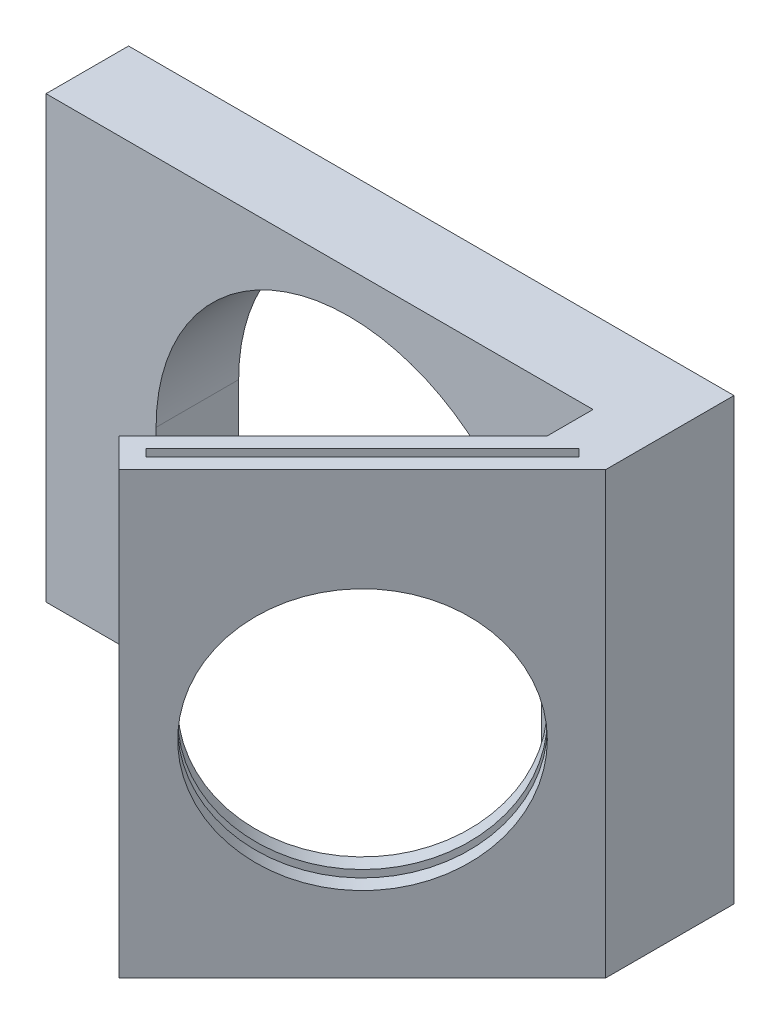
ISO-10303-21;
HEADER;
FILE_DESCRIPTION(('STEP AP214'),'2;1');
FILE_NAME('part.step','',(''),(''),'','','');
FILE_SCHEMA(('AUTOMOTIVE_DESIGN { 1 0 10303 214 1 1 1 1 }'));
ENDSEC;
DATA;
#1=APPLICATION_CONTEXT('core data for automotive mechanical design processes');
#2=APPLICATION_PROTOCOL_DEFINITION('international standard','automotive_design',2000,#1);
#3=PRODUCT_CONTEXT('',#1,'mechanical');
#4=PRODUCT('Part','Part','',(#3));
#5=PRODUCT_RELATED_PRODUCT_CATEGORY('part','',(#4));
#6=PRODUCT_DEFINITION_FORMATION('','',#4);
#7=PRODUCT_DEFINITION_CONTEXT('part definition',#1,'design');
#8=PRODUCT_DEFINITION('design','',#6,#7);
#9=PRODUCT_DEFINITION_SHAPE('','',#8);
#10=(LENGTH_UNIT() NAMED_UNIT(*) SI_UNIT(.MILLI.,.METRE.));
#11=(NAMED_UNIT(*) PLANE_ANGLE_UNIT() SI_UNIT($,.RADIAN.));
#12=(NAMED_UNIT(*) SI_UNIT($,.STERADIAN.) SOLID_ANGLE_UNIT());
#13=UNCERTAINTY_MEASURE_WITH_UNIT(LENGTH_MEASURE(1.E-05),#10,'distance_accuracy_value','');
#14=(GEOMETRIC_REPRESENTATION_CONTEXT(3) GLOBAL_UNCERTAINTY_ASSIGNED_CONTEXT((#13)) GLOBAL_UNIT_ASSIGNED_CONTEXT((#10,
#11,#12)) REPRESENTATION_CONTEXT('',''));
#15=CARTESIAN_POINT('',(0.,0.,0.));
#16=DIRECTION('',(0.,0.,1.));
#17=DIRECTION('',(1.,0.,0.));
#18=AXIS2_PLACEMENT_3D('',#15,#16,#17);
#19=CARTESIAN_POINT('',(-13.5010125,0.,-8.50101250000002));
#20=DIRECTION('',(0.707106781186546,0.,0.707106781186549));
#21=DIRECTION('',(0.707106781186549,0.,-0.707106781186546));
#22=AXIS2_PLACEMENT_3D('',#19,#20,#21);
#23=CYLINDRICAL_SURFACE('',#22,9.5);
#24=CARTESIAN_POINT('',(11.8353400204434,0.,16.8353400204434));
#25=DIRECTION('',(-0.707106781186548,0.,-0.707106781186548));
#26=DIRECTION('',(-0.707106781186547,0.,0.707106781186548));
#27=AXIS2_PLACEMENT_3D('',#24,#25,#26);
#28=CIRCLE('',#27,9.5);
#29=CARTESIAN_POINT('',(5.11782559917116,0.,23.5528544417156));
#30=VERTEX_POINT('',#29);
#31=EDGE_CURVE('E36',#30,#30,#28,.F.);
#32=ORIENTED_EDGE('',*,*,#31,.T.);
#33=EDGE_LOOP('',(#32));
#34=FACE_BOUND('',#33,.T.);
#35=CARTESIAN_POINT('',(11.0398448916085,0.,16.0398448916086));
#36=DIRECTION('',(-0.707106781186544,0.,-0.707106781186551));
#37=DIRECTION('',(-0.707106781186551,0.,0.707106781186544));
#38=AXIS2_PLACEMENT_3D('',#35,#36,#37);
#39=CIRCLE('',#38,9.5);
#40=CARTESIAN_POINT('',(17.7573593128808,0.,9.3223304703364));
#41=VERTEX_POINT('',#40);
#42=EDGE_CURVE('E55',#41,#41,#39,.F.);
#43=ORIENTED_EDGE('',*,*,#42,.F.);
#44=EDGE_LOOP('',(#43));
#45=FACE_BOUND('',#44,.T.);
#46=ADVANCED_FACE('F32',(#34,#45),#23,.F.);
#47=CARTESIAN_POINT('',(-22.,17.,6.));
#48=DIRECTION('',(0.,-1.,0.));
#49=DIRECTION('',(0.,0.,-1.));
#50=AXIS2_PLACEMENT_3D('',#47,#48,#49);
#51=PLANE('',#50);
#52=DIRECTION('',(0.707106781186547,0.,-0.707106781186548));
#53=VECTOR('',#52,1.);
#54=CARTESIAN_POINT('',(4.49910716563293,17.,25.2322330470337));
#55=LINE('',#54,#53);
#56=CARTESIAN_POINT('',(4.49910716563293,17.,25.2322330470336));
#57=VERTEX_POINT('',#56);
#58=CARTESIAN_POINT('',(20.2322330470336,17.,9.49910716563297));
#59=VERTEX_POINT('',#58);
#60=EDGE_CURVE('E179',#57,#59,#55,.T.);
#61=ORIENTED_EDGE('',*,*,#60,.F.);
#62=DIRECTION('',(0.707106781186546,0.,0.707106781186549));
#63=VECTOR('',#62,1.);
#64=CARTESIAN_POINT('',(3.96877707974302,17.,24.7019029611437));
#65=LINE('',#64,#63);
#66=CARTESIAN_POINT('',(3.96877707974302,17.,24.7019029611437));
#67=VERTEX_POINT('',#66);
#68=EDGE_CURVE('E49',#67,#57,#65,.T.);
#69=ORIENTED_EDGE('',*,*,#68,.F.);
#70=DIRECTION('',(-0.707106781186548,0.,0.707106781186548));
#71=VECTOR('',#70,1.);
#72=CARTESIAN_POINT('',(19.7019029611437,17.,8.96877707974307));
#73=LINE('',#72,#71);
#74=CARTESIAN_POINT('',(19.7019029611437,17.,8.96877707974307));
#75=VERTEX_POINT('',#74);
#76=EDGE_CURVE('E170',#75,#67,#73,.T.);
#77=ORIENTED_EDGE('',*,*,#76,.F.);
#78=DIRECTION('',(-0.707106781186554,0.,-0.707106781186541));
#79=VECTOR('',#78,1.);
#80=CARTESIAN_POINT('',(20.2322330470336,17.,9.49910716563297));
#81=LINE('',#80,#79);
#82=EDGE_CURVE('E173',#59,#75,#81,.T.);
#83=ORIENTED_EDGE('',*,*,#82,.F.);
#84=EDGE_LOOP('',(#61,#69,#77,#83));
#85=FACE_BOUND('',#84,.T.);
#86=DIRECTION('',(-1.,0.,0.));
#87=VECTOR('',#86,1.);
#88=CARTESIAN_POINT('',(-22.,17.,0.));
#89=LINE('',#88,#87);
#90=CARTESIAN_POINT('',(22.,17.,0.));
#91=VERTEX_POINT('',#90);
#92=CARTESIAN_POINT('',(-22.,17.,0.));
#93=VERTEX_POINT('',#92);
#94=EDGE_CURVE('E222',#91,#93,#89,.T.);
#95=ORIENTED_EDGE('',*,*,#94,.T.);
#96=DIRECTION('',(0.,0.,-1.));
#97=VECTOR('',#96,1.);
#98=CARTESIAN_POINT('',(-22.,17.,6.));
#99=LINE('',#98,#97);
#100=CARTESIAN_POINT('',(-22.,17.,6.));
#101=VERTEX_POINT('',#100);
#102=EDGE_CURVE('E11',#101,#93,#99,.T.);
#103=ORIENTED_EDGE('',*,*,#102,.F.);
#104=DIRECTION('',(-1.,0.,0.));
#105=VECTOR('',#104,1.);
#106=CARTESIAN_POINT('',(-22.,17.,6.));
#107=LINE('',#106,#105);
#108=CARTESIAN_POINT('',(17.7573593128807,17.,6.));
#109=VERTEX_POINT('',#108);
#110=EDGE_CURVE('E344',#109,#101,#107,.T.);
#111=ORIENTED_EDGE('',*,*,#110,.F.);
#112=DIRECTION('',(0.,0.,-1.));
#113=VECTOR('',#112,1.);
#114=CARTESIAN_POINT('',(17.7573593128807,17.,6.));
#115=LINE('',#114,#113);
#116=CARTESIAN_POINT('',(17.7573593128808,17.,9.3223304703364));
#117=VERTEX_POINT('',#116);
#118=EDGE_CURVE('E204',#117,#109,#115,.T.);
#119=ORIENTED_EDGE('',*,*,#118,.F.);
#120=DIRECTION('',(0.707106781186551,0.,-0.707106781186544));
#121=VECTOR('',#120,1.);
#122=CARTESIAN_POINT('',(17.7573593128808,17.,9.3223304703364));
#123=LINE('',#122,#121);
#124=CARTESIAN_POINT('',(2.20101012677665,17.,24.8786796564404));
#125=VERTEX_POINT('',#124);
#126=EDGE_CURVE('E201',#125,#117,#123,.T.);
#127=ORIENTED_EDGE('',*,*,#126,.F.);
#128=DIRECTION('',(-0.707106781186547,0.,-0.707106781186548));
#129=VECTOR('',#128,1.);
#130=CARTESIAN_POINT('',(2.20101012677665,17.,24.8786796564404));
#131=LINE('',#130,#129);
#132=CARTESIAN_POINT('',(4.32233047033629,17.,27.));
#133=VERTEX_POINT('',#132);
#134=EDGE_CURVE('E197',#133,#125,#131,.T.);
#135=ORIENTED_EDGE('',*,*,#134,.F.);
#136=DIRECTION('',(-0.707106781186549,0.,0.707106781186546));
#137=VECTOR('',#136,1.);
#138=CARTESIAN_POINT('',(22.,17.,9.32233047033637));
#139=LINE('',#138,#137);
#140=CARTESIAN_POINT('',(22.,17.,9.32233047033637));
#141=VERTEX_POINT('',#140);
#142=EDGE_CURVE('E194',#141,#133,#139,.T.);
#143=ORIENTED_EDGE('',*,*,#142,.F.);
#144=DIRECTION('',(0.,0.,-1.));
#145=VECTOR('',#144,1.);
#146=CARTESIAN_POINT('',(22.,17.,6.));
#147=LINE('',#146,#145);
#148=EDGE_CURVE('E345',#141,#91,#147,.T.);
#149=ORIENTED_EDGE('',*,*,#148,.T.);
#150=EDGE_LOOP('',(#95,#103,#111,#119,#127,#135,#143,#149));
#151=FACE_BOUND('',#150,.T.);
#152=ADVANCED_FACE('F34',(#85,#151),#51,.F.);
#153=CARTESIAN_POINT('',(-22.,17.,6.));
#154=DIRECTION('',(1.,0.,0.));
#155=DIRECTION('',(0.,1.,0.));
#156=AXIS2_PLACEMENT_3D('',#153,#154,#155);
#157=PLANE('',#156);
#158=DIRECTION('',(0.,-1.,0.));
#159=VECTOR('',#158,1.);
#160=CARTESIAN_POINT('',(-22.,17.,0.));
#161=LINE('',#160,#159);
#162=CARTESIAN_POINT('',(-22.,-15.,0.));
#163=VERTEX_POINT('',#162);
#164=EDGE_CURVE('E314',#93,#163,#161,.T.);
#165=ORIENTED_EDGE('',*,*,#164,.T.);
#166=DIRECTION('',(0.,0.,-1.));
#167=VECTOR('',#166,1.);
#168=CARTESIAN_POINT('',(-22.,-15.,6.));
#169=LINE('',#168,#167);
#170=CARTESIAN_POINT('',(-22.,-15.,6.));
#171=VERTEX_POINT('',#170);
#172=EDGE_CURVE('E41',#171,#163,#169,.T.);
#173=ORIENTED_EDGE('',*,*,#172,.F.);
#174=DIRECTION('',(0.,-1.,0.));
#175=VECTOR('',#174,1.);
#176=CARTESIAN_POINT('',(-22.,17.,6.));
#177=LINE('',#176,#175);
#178=EDGE_CURVE('E361',#101,#171,#177,.T.);
#179=ORIENTED_EDGE('',*,*,#178,.F.);
#180=ORIENTED_EDGE('',*,*,#102,.T.);
#181=EDGE_LOOP('',(#165,#173,#179,#180));
#182=FACE_BOUND('',#181,.T.);
#183=ADVANCED_FACE('F259',(#182),#157,.F.);
#184=CARTESIAN_POINT('',(-22.,-15.,6.));
#185=DIRECTION('',(0.,1.,0.));
#186=DIRECTION('',(0.,0.,1.));
#187=AXIS2_PLACEMENT_3D('',#184,#185,#186);
#188=PLANE('',#187);
#189=DIRECTION('',(1.,0.,0.));
#190=VECTOR('',#189,1.);
#191=CARTESIAN_POINT('',(-22.,-15.,0.));
#192=LINE('',#191,#190);
#193=CARTESIAN_POINT('',(-14.,-15.,0.));
#194=VERTEX_POINT('',#193);
#195=EDGE_CURVE('E322',#163,#194,#192,.T.);
#196=ORIENTED_EDGE('',*,*,#195,.T.);
#197=DIRECTION('',(0.,0.,-1.));
#198=VECTOR('',#197,1.);
#199=CARTESIAN_POINT('',(-14.,-15.,6.));
#200=LINE('',#199,#198);
#201=CARTESIAN_POINT('',(-14.,-15.,6.));
#202=VERTEX_POINT('',#201);
#203=EDGE_CURVE('E327',#202,#194,#200,.T.);
#204=ORIENTED_EDGE('',*,*,#203,.F.);
#205=DIRECTION('',(1.,0.,0.));
#206=VECTOR('',#205,1.);
#207=CARTESIAN_POINT('',(-22.,-15.,6.));
#208=LINE('',#207,#206);
#209=EDGE_CURVE('E326',#171,#202,#208,.T.);
#210=ORIENTED_EDGE('',*,*,#209,.F.);
#211=ORIENTED_EDGE('',*,*,#172,.T.);
#212=EDGE_LOOP('',(#196,#204,#210,#211));
#213=FACE_BOUND('',#212,.T.);
#214=ADVANCED_FACE('F305',(#213),#188,.F.);
#215=CARTESIAN_POINT('',(-14.,0.,6.));
#216=DIRECTION('',(-1.,0.,0.));
#217=DIRECTION('',(0.,0.,1.));
#218=AXIS2_PLACEMENT_3D('',#215,#216,#217);
#219=PLANE('',#218);
#220=DIRECTION('',(0.,1.,0.));
#221=VECTOR('',#220,1.);
#222=CARTESIAN_POINT('',(-14.,0.,0.));
#223=LINE('',#222,#221);
#224=CARTESIAN_POINT('',(-14.,0.,0.));
#225=VERTEX_POINT('',#224);
#226=EDGE_CURVE('E331',#194,#225,#223,.T.);
#227=ORIENTED_EDGE('',*,*,#226,.T.);
#228=DIRECTION('',(0.,0.,-1.));
#229=VECTOR('',#228,1.);
#230=CARTESIAN_POINT('',(-14.,0.,6.));
#231=LINE('',#230,#229);
#232=CARTESIAN_POINT('',(-14.,0.,6.));
#233=VERTEX_POINT('',#232);
#234=EDGE_CURVE('E357',#233,#225,#231,.T.);
#235=ORIENTED_EDGE('',*,*,#234,.F.);
#236=DIRECTION('',(0.,1.,0.));
#237=VECTOR('',#236,1.);
#238=CARTESIAN_POINT('',(-14.,0.,6.));
#239=LINE('',#238,#237);
#240=EDGE_CURVE('E368',#202,#233,#239,.T.);
#241=ORIENTED_EDGE('',*,*,#240,.F.);
#242=ORIENTED_EDGE('',*,*,#203,.T.);
#243=EDGE_LOOP('',(#227,#235,#241,#242));
#244=FACE_BOUND('',#243,.T.);
#245=ADVANCED_FACE('F301',(#244),#219,.F.);
#246=CARTESIAN_POINT('',(0.,0.,6.));
#247=DIRECTION('',(0.,0.,-1.));
#248=DIRECTION('',(-1.,0.,0.));
#249=AXIS2_PLACEMENT_3D('',#246,#247,#248);
#250=CYLINDRICAL_SURFACE('',#249,14.);
#251=CARTESIAN_POINT('',(0.,0.,0.));
#252=DIRECTION('',(0.,0.,-1.));
#253=DIRECTION('',(1.,0.,0.));
#254=AXIS2_PLACEMENT_3D('',#251,#252,#253);
#255=CIRCLE('',#254,14.);
#256=CARTESIAN_POINT('',(14.,0.,0.));
#257=VERTEX_POINT('',#256);
#258=EDGE_CURVE('E333',#225,#257,#255,.T.);
#259=ORIENTED_EDGE('',*,*,#258,.T.);
#260=DIRECTION('',(0.,0.,-1.));
#261=VECTOR('',#260,1.);
#262=CARTESIAN_POINT('',(14.,0.,6.));
#263=LINE('',#262,#261);
#264=CARTESIAN_POINT('',(14.,0.,6.));
#265=VERTEX_POINT('',#264);
#266=EDGE_CURVE('E354',#265,#257,#263,.T.);
#267=ORIENTED_EDGE('',*,*,#266,.F.);
#268=CARTESIAN_POINT('',(0.,0.,6.));
#269=DIRECTION('',(0.,0.,-1.));
#270=DIRECTION('',(1.,0.,0.));
#271=AXIS2_PLACEMENT_3D('',#268,#269,#270);
#272=CIRCLE('',#271,14.);
#273=EDGE_CURVE('E370',#233,#265,#272,.T.);
#274=ORIENTED_EDGE('',*,*,#273,.F.);
#275=ORIENTED_EDGE('',*,*,#234,.T.);
#276=EDGE_LOOP('',(#259,#267,#274,#275));
#277=FACE_BOUND('',#276,.T.);
#278=ADVANCED_FACE('F297',(#277),#250,.F.);
#279=CARTESIAN_POINT('',(14.,0.,6.));
#280=DIRECTION('',(1.,0.,0.));
#281=DIRECTION('',(0.,0.,-1.));
#282=AXIS2_PLACEMENT_3D('',#279,#280,#281);
#283=PLANE('',#282);
#284=DIRECTION('',(0.,-1.,0.));
#285=VECTOR('',#284,1.);
#286=CARTESIAN_POINT('',(14.,0.,0.));
#287=LINE('',#286,#285);
#288=CARTESIAN_POINT('',(14.,-15.,0.));
#289=VERTEX_POINT('',#288);
#290=EDGE_CURVE('E338',#257,#289,#287,.T.);
#291=ORIENTED_EDGE('',*,*,#290,.T.);
#292=DIRECTION('',(0.,0.,-1.));
#293=VECTOR('',#292,1.);
#294=CARTESIAN_POINT('',(14.,-15.,6.));
#295=LINE('',#294,#293);
#296=CARTESIAN_POINT('',(14.,-15.,6.));
#297=VERTEX_POINT('',#296);
#298=EDGE_CURVE('E351',#297,#289,#295,.T.);
#299=ORIENTED_EDGE('',*,*,#298,.F.);
#300=DIRECTION('',(0.,-1.,0.));
#301=VECTOR('',#300,1.);
#302=CARTESIAN_POINT('',(14.,0.,6.));
#303=LINE('',#302,#301);
#304=EDGE_CURVE('E372',#265,#297,#303,.T.);
#305=ORIENTED_EDGE('',*,*,#304,.F.);
#306=ORIENTED_EDGE('',*,*,#266,.T.);
#307=EDGE_LOOP('',(#291,#299,#305,#306));
#308=FACE_BOUND('',#307,.T.);
#309=ADVANCED_FACE('F293',(#308),#283,.F.);
#310=CARTESIAN_POINT('',(14.,-15.,6.));
#311=DIRECTION('',(0.,1.,0.));
#312=DIRECTION('',(0.,0.,1.));
#313=AXIS2_PLACEMENT_3D('',#310,#311,#312);
#314=PLANE('',#313);
#315=DIRECTION('',(1.,0.,0.));
#316=VECTOR('',#315,1.);
#317=CARTESIAN_POINT('',(14.,-15.,0.));
#318=LINE('',#317,#316);
#319=CARTESIAN_POINT('',(22.,-15.,0.));
#320=VERTEX_POINT('',#319);
#321=EDGE_CURVE('E340',#289,#320,#318,.T.);
#322=ORIENTED_EDGE('',*,*,#321,.T.);
#323=DIRECTION('',(0.,0.,-1.));
#324=VECTOR('',#323,1.);
#325=CARTESIAN_POINT('',(22.,-15.,6.));
#326=LINE('',#325,#324);
#327=CARTESIAN_POINT('',(22.,-15.,9.32233047033637));
#328=VERTEX_POINT('',#327);
#329=EDGE_CURVE('E348',#328,#320,#326,.T.);
#330=ORIENTED_EDGE('',*,*,#329,.F.);
#331=DIRECTION('',(-0.707106781186549,0.,0.707106781186546));
#332=VECTOR('',#331,1.);
#333=CARTESIAN_POINT('',(22.,-15.,9.32233047033637));
#334=LINE('',#333,#332);
#335=CARTESIAN_POINT('',(4.32233047033629,-15.,27.));
#336=VERTEX_POINT('',#335);
#337=EDGE_CURVE('E190',#328,#336,#334,.T.);
#338=ORIENTED_EDGE('',*,*,#337,.T.);
#339=DIRECTION('',(-0.707106781186547,0.,-0.707106781186548));
#340=VECTOR('',#339,1.);
#341=CARTESIAN_POINT('',(2.20101012677665,-15.,24.8786796564404));
#342=LINE('',#341,#340);
#343=CARTESIAN_POINT('',(2.20101012677665,-15.,24.8786796564404));
#344=VERTEX_POINT('',#343);
#345=EDGE_CURVE('E207',#336,#344,#342,.T.);
#346=ORIENTED_EDGE('',*,*,#345,.T.);
#347=DIRECTION('',(0.707106781186551,0.,-0.707106781186544));
#348=VECTOR('',#347,1.);
#349=CARTESIAN_POINT('',(17.7573593128808,-15.,9.3223304703364));
#350=LINE('',#349,#348);
#351=CARTESIAN_POINT('',(17.7573593128808,-15.,9.3223304703364));
#352=VERTEX_POINT('',#351);
#353=EDGE_CURVE('E210',#344,#352,#350,.T.);
#354=ORIENTED_EDGE('',*,*,#353,.T.);
#355=DIRECTION('',(0.,0.,-1.));
#356=VECTOR('',#355,1.);
#357=CARTESIAN_POINT('',(17.7573593128807,-15.,6.));
#358=LINE('',#357,#356);
#359=CARTESIAN_POINT('',(17.7573593128807,-15.,6.));
#360=VERTEX_POINT('',#359);
#361=EDGE_CURVE('E198',#352,#360,#358,.T.);
#362=ORIENTED_EDGE('',*,*,#361,.T.);
#363=DIRECTION('',(1.,0.,0.));
#364=VECTOR('',#363,1.);
#365=CARTESIAN_POINT('',(14.,-15.,6.));
#366=LINE('',#365,#364);
#367=EDGE_CURVE('E223',#297,#360,#366,.T.);
#368=ORIENTED_EDGE('',*,*,#367,.F.);
#369=ORIENTED_EDGE('',*,*,#298,.T.);
#370=EDGE_LOOP('',(#322,#330,#338,#346,#354,#362,#368,#369));
#371=FACE_BOUND('',#370,.T.);
#372=ADVANCED_FACE('F289',(#371),#314,.F.);
#373=CARTESIAN_POINT('',(22.,-15.,6.));
#374=DIRECTION('',(-1.,0.,0.));
#375=DIRECTION('',(0.,-1.,0.));
#376=AXIS2_PLACEMENT_3D('',#373,#374,#375);
#377=PLANE('',#376);
#378=DIRECTION('',(0.,1.,0.));
#379=VECTOR('',#378,1.);
#380=CARTESIAN_POINT('',(22.,-15.,0.));
#381=LINE('',#380,#379);
#382=EDGE_CURVE('E342',#320,#91,#381,.T.);
#383=ORIENTED_EDGE('',*,*,#382,.T.);
#384=ORIENTED_EDGE('',*,*,#148,.F.);
#385=DIRECTION('',(0.,-1.,0.));
#386=VECTOR('',#385,1.);
#387=CARTESIAN_POINT('',(22.,17.,9.32233047033637));
#388=LINE('',#387,#386);
#389=EDGE_CURVE('E232',#141,#328,#388,.T.);
#390=ORIENTED_EDGE('',*,*,#389,.T.);
#391=ORIENTED_EDGE('',*,*,#329,.T.);
#392=EDGE_LOOP('',(#383,#384,#390,#391));
#393=FACE_BOUND('',#392,.T.);
#394=ADVANCED_FACE('F282',(#393),#377,.F.);
#395=CARTESIAN_POINT('',(0.,0.,6.));
#396=DIRECTION('',(0.,0.,1.));
#397=DIRECTION('',(1.,0.,0.));
#398=AXIS2_PLACEMENT_3D('',#395,#396,#397);
#399=PLANE('',#398);
#400=DIRECTION('',(0.,-1.,0.));
#401=VECTOR('',#400,1.);
#402=CARTESIAN_POINT('',(17.7573593128807,17.,6.));
#403=LINE('',#402,#401);
#404=EDGE_CURVE('E218',#109,#360,#403,.T.);
#405=ORIENTED_EDGE('',*,*,#404,.F.);
#406=ORIENTED_EDGE('',*,*,#110,.T.);
#407=ORIENTED_EDGE('',*,*,#178,.T.);
#408=ORIENTED_EDGE('',*,*,#209,.T.);
#409=ORIENTED_EDGE('',*,*,#240,.T.);
#410=ORIENTED_EDGE('',*,*,#273,.T.);
#411=ORIENTED_EDGE('',*,*,#304,.T.);
#412=ORIENTED_EDGE('',*,*,#367,.T.);
#413=EDGE_LOOP('',(#405,#406,#407,#408,#409,#410,#411,#412));
#414=FACE_BOUND('',#413,.T.);
#415=ADVANCED_FACE('F279',(#414),#399,.T.);
#416=CARTESIAN_POINT('',(0.,0.,0.));
#417=DIRECTION('',(0.,0.,1.));
#418=DIRECTION('',(1.,0.,0.));
#419=AXIS2_PLACEMENT_3D('',#416,#417,#418);
#420=PLANE('',#419);
#421=ORIENTED_EDGE('',*,*,#94,.F.);
#422=ORIENTED_EDGE('',*,*,#382,.F.);
#423=ORIENTED_EDGE('',*,*,#321,.F.);
#424=ORIENTED_EDGE('',*,*,#290,.F.);
#425=ORIENTED_EDGE('',*,*,#258,.F.);
#426=ORIENTED_EDGE('',*,*,#226,.F.);
#427=ORIENTED_EDGE('',*,*,#195,.F.);
#428=ORIENTED_EDGE('',*,*,#164,.F.);
#429=EDGE_LOOP('',(#421,#422,#423,#424,#425,#426,#427,#428));
#430=FACE_BOUND('',#429,.T.);
#431=ADVANCED_FACE('F267',(#430),#420,.F.);
#432=CARTESIAN_POINT('',(17.7573593128807,17.,6.));
#433=DIRECTION('',(-1.,0.,0.));
#434=DIRECTION('',(0.,0.,1.));
#435=AXIS2_PLACEMENT_3D('',#432,#433,#434);
#436=PLANE('',#435);
#437=ORIENTED_EDGE('',*,*,#361,.F.);
#438=DIRECTION('',(0.,-1.,0.));
#439=VECTOR('',#438,1.);
#440=CARTESIAN_POINT('',(17.7573593128808,17.,9.3223304703364));
#441=LINE('',#440,#439);
#442=EDGE_CURVE('E395',#41,#352,#441,.T.);
#443=ORIENTED_EDGE('',*,*,#442,.F.);
#444=EDGE_CURVE('E215',#117,#41,#441,.T.);
#445=ORIENTED_EDGE('',*,*,#444,.F.);
#446=ORIENTED_EDGE('',*,*,#118,.T.);
#447=ORIENTED_EDGE('',*,*,#404,.T.);
#448=EDGE_LOOP('',(#437,#443,#445,#446,#447));
#449=FACE_BOUND('',#448,.T.);
#450=ADVANCED_FACE('F263',(#449),#436,.T.);
#451=CARTESIAN_POINT('',(17.7573593128808,17.,9.3223304703364));
#452=DIRECTION('',(-0.707106781186544,0.,-0.707106781186551));
#453=DIRECTION('',(-0.707106781186551,0.,0.707106781186544));
#454=AXIS2_PLACEMENT_3D('',#451,#452,#453);
#455=PLANE('',#454);
#456=ORIENTED_EDGE('',*,*,#444,.T.);
#457=ORIENTED_EDGE('',*,*,#42,.T.);
#458=ORIENTED_EDGE('',*,*,#442,.T.);
#459=ORIENTED_EDGE('',*,*,#353,.F.);
#460=DIRECTION('',(0.,-1.,0.));
#461=VECTOR('',#460,1.);
#462=CARTESIAN_POINT('',(2.20101012677665,17.,24.8786796564404));
#463=LINE('',#462,#461);
#464=EDGE_CURVE('E397',#125,#344,#463,.T.);
#465=ORIENTED_EDGE('',*,*,#464,.F.);
#466=ORIENTED_EDGE('',*,*,#126,.T.);
#467=EDGE_LOOP('',(#456,#457,#458,#459,#465,#466));
#468=FACE_BOUND('',#467,.T.);
#469=ADVANCED_FACE('F266',(#468),#455,.T.);
#470=CARTESIAN_POINT('',(2.20101012677665,17.,24.8786796564404));
#471=DIRECTION('',(-0.707106781186548,0.,0.707106781186547));
#472=DIRECTION('',(0.707106781186547,0.,0.707106781186548));
#473=AXIS2_PLACEMENT_3D('',#470,#471,#472);
#474=PLANE('',#473);
#475=ORIENTED_EDGE('',*,*,#345,.F.);
#476=DIRECTION('',(0.,-1.,0.));
#477=VECTOR('',#476,1.);
#478=CARTESIAN_POINT('',(4.32233047033629,17.,27.));
#479=LINE('',#478,#477);
#480=EDGE_CURVE('E400',#133,#336,#479,.T.);
#481=ORIENTED_EDGE('',*,*,#480,.F.);
#482=ORIENTED_EDGE('',*,*,#134,.T.);
#483=ORIENTED_EDGE('',*,*,#464,.T.);
#484=EDGE_LOOP('',(#475,#481,#482,#483));
#485=FACE_BOUND('',#484,.T.);
#486=ADVANCED_FACE('F271',(#485),#474,.T.);
#487=CARTESIAN_POINT('',(22.,17.,9.32233047033637));
#488=DIRECTION('',(0.707106781186546,0.,0.707106781186549));
#489=DIRECTION('',(0.707106781186549,0.,-0.707106781186546));
#490=AXIS2_PLACEMENT_3D('',#487,#488,#489);
#491=PLANE('',#490);
#492=CARTESIAN_POINT('',(13.1611652351681,0.,18.1611652351682));
#493=DIRECTION('',(0.707106781186546,0.,0.707106781186549));
#494=DIRECTION('',(0.707106781186549,0.,-0.707106781186546));
#495=AXIS2_PLACEMENT_3D('',#492,#493,#494);
#496=CIRCLE('',#495,9.5);
#497=CARTESIAN_POINT('',(19.8786796564404,0.,11.443650813896));
#498=VERTEX_POINT('',#497);
#499=EDGE_CURVE('E191',#498,#498,#496,.T.);
#500=ORIENTED_EDGE('',*,*,#499,.F.);
#501=EDGE_LOOP('',(#500));
#502=FACE_BOUND('',#501,.T.);
#503=ORIENTED_EDGE('',*,*,#337,.F.);
#504=ORIENTED_EDGE('',*,*,#389,.F.);
#505=ORIENTED_EDGE('',*,*,#142,.T.);
#506=ORIENTED_EDGE('',*,*,#480,.T.);
#507=EDGE_LOOP('',(#503,#504,#505,#506));
#508=FACE_BOUND('',#507,.T.);
#509=ADVANCED_FACE('F251',(#502,#508),#491,.T.);
#510=CARTESIAN_POINT('',(12.3656701063333,0.,17.3656701063333));
#511=DIRECTION('',(0.707106781186548,0.,0.707106781186547));
#512=DIRECTION('',(0.707106781186547,0.,-0.707106781186548));
#513=AXIS2_PLACEMENT_3D('',#510,#511,#512);
#514=CIRCLE('',#513,9.5);
#515=CARTESIAN_POINT('',(19.0831845276055,0.,10.6481556850611));
#516=VERTEX_POINT('',#515);
#517=EDGE_CURVE('E185',#516,#516,#514,.F.);
#518=ORIENTED_EDGE('',*,*,#517,.T.);
#519=EDGE_LOOP('',(#518));
#520=FACE_BOUND('',#519,.T.);
#521=ORIENTED_EDGE('',*,*,#499,.T.);
#522=EDGE_LOOP('',(#521));
#523=FACE_BOUND('',#522,.T.);
#524=ADVANCED_FACE('F243',(#520,#523),#23,.F.);
#525=CARTESIAN_POINT('',(19.7019029611437,-14.,8.96877707974307));
#526=DIRECTION('',(-0.707106781186548,0.,-0.707106781186548));
#527=DIRECTION('',(-0.707106781186547,0.,0.707106781186548));
#528=AXIS2_PLACEMENT_3D('',#525,#526,#527);
#529=PLANE('',#528);
#530=ORIENTED_EDGE('',*,*,#76,.T.);
#531=DIRECTION('',(0.,1.,0.));
#532=VECTOR('',#531,1.);
#533=CARTESIAN_POINT('',(3.96877707974302,-14.,24.7019029611437));
#534=LINE('',#533,#532);
#535=CARTESIAN_POINT('',(3.96877707974302,-14.,24.7019029611437));
#536=VERTEX_POINT('',#535);
#537=EDGE_CURVE('E183',#536,#67,#534,.T.);
#538=ORIENTED_EDGE('',*,*,#537,.F.);
#539=DIRECTION('',(-0.707106781186548,0.,0.707106781186548));
#540=VECTOR('',#539,1.);
#541=CARTESIAN_POINT('',(19.7019029611437,-14.,8.96877707974307));
#542=LINE('',#541,#540);
#543=CARTESIAN_POINT('',(19.7019029611437,-14.,8.96877707974307));
#544=VERTEX_POINT('',#543);
#545=EDGE_CURVE('E157',#544,#536,#542,.T.);
#546=ORIENTED_EDGE('',*,*,#545,.F.);
#547=DIRECTION('',(0.,1.,0.));
#548=VECTOR('',#547,1.);
#549=CARTESIAN_POINT('',(19.7019029611437,-14.,8.96877707974307));
#550=LINE('',#549,#548);
#551=EDGE_CURVE('E186',#544,#75,#550,.T.);
#552=ORIENTED_EDGE('',*,*,#551,.T.);
#553=EDGE_LOOP('',(#530,#538,#546,#552));
#554=FACE_BOUND('',#553,.T.);
#555=ORIENTED_EDGE('',*,*,#31,.F.);
#556=EDGE_LOOP('',(#555));
#557=FACE_BOUND('',#556,.T.);
#558=ADVANCED_FACE('F241',(#554,#557),#529,.F.);
#559=CARTESIAN_POINT('',(4.49910716563293,-14.,25.2322330470337));
#560=DIRECTION('',(0.707106781186548,0.,0.707106781186547));
#561=DIRECTION('',(0.707106781186547,0.,-0.707106781186548));
#562=AXIS2_PLACEMENT_3D('',#559,#560,#561);
#563=PLANE('',#562);
#564=ORIENTED_EDGE('',*,*,#60,.T.);
#565=DIRECTION('',(0.,1.,0.));
#566=VECTOR('',#565,1.);
#567=CARTESIAN_POINT('',(20.2322330470336,-14.,9.49910716563297));
#568=LINE('',#567,#566);
#569=CARTESIAN_POINT('',(20.2322330470336,-14.,9.49910716563297));
#570=VERTEX_POINT('',#569);
#571=EDGE_CURVE('E156',#570,#59,#568,.T.);
#572=ORIENTED_EDGE('',*,*,#571,.F.);
#573=DIRECTION('',(0.707106781186547,0.,-0.707106781186548));
#574=VECTOR('',#573,1.);
#575=CARTESIAN_POINT('',(4.49910716563293,-14.,25.2322330470337));
#576=LINE('',#575,#574);
#577=CARTESIAN_POINT('',(4.49910716563293,-14.,25.2322330470337));
#578=VERTEX_POINT('',#577);
#579=EDGE_CURVE('E160',#578,#570,#576,.T.);
#580=ORIENTED_EDGE('',*,*,#579,.F.);
#581=DIRECTION('',(0.,1.,0.));
#582=VECTOR('',#581,1.);
#583=CARTESIAN_POINT('',(4.49910716563293,-14.,25.2322330470337));
#584=LINE('',#583,#582);
#585=EDGE_CURVE('E147',#578,#57,#584,.T.);
#586=ORIENTED_EDGE('',*,*,#585,.T.);
#587=EDGE_LOOP('',(#564,#572,#580,#586));
#588=FACE_BOUND('',#587,.T.);
#589=ORIENTED_EDGE('',*,*,#517,.F.);
#590=EDGE_LOOP('',(#589));
#591=FACE_BOUND('',#590,.T.);
#592=ADVANCED_FACE('F161',(#588,#591),#563,.F.);
#593=CARTESIAN_POINT('',(3.96877707974302,-14.,24.7019029611437));
#594=DIRECTION('',(-0.707106781186549,0.,0.707106781186546));
#595=DIRECTION('',(0.707106781186546,0.,0.707106781186549));
#596=AXIS2_PLACEMENT_3D('',#593,#594,#595);
#597=PLANE('',#596);
#598=ORIENTED_EDGE('',*,*,#68,.T.);
#599=ORIENTED_EDGE('',*,*,#585,.F.);
#600=DIRECTION('',(0.707106781186546,0.,0.707106781186549));
#601=VECTOR('',#600,1.);
#602=CARTESIAN_POINT('',(3.96877707974302,-14.,24.7019029611437));
#603=LINE('',#602,#601);
#604=EDGE_CURVE('E151',#536,#578,#603,.T.);
#605=ORIENTED_EDGE('',*,*,#604,.F.);
#606=ORIENTED_EDGE('',*,*,#537,.T.);
#607=EDGE_LOOP('',(#598,#599,#605,#606));
#608=FACE_BOUND('',#607,.T.);
#609=ADVANCED_FACE('F149',(#608),#597,.F.);
#610=CARTESIAN_POINT('',(20.2322330470336,-14.,9.49910716563297));
#611=DIRECTION('',(0.707106781186541,0.,-0.707106781186555));
#612=DIRECTION('',(-0.707106781186554,0.,-0.707106781186541));
#613=AXIS2_PLACEMENT_3D('',#610,#611,#612);
#614=PLANE('',#613);
#615=ORIENTED_EDGE('',*,*,#82,.T.);
#616=ORIENTED_EDGE('',*,*,#551,.F.);
#617=DIRECTION('',(-0.707106781186554,0.,-0.707106781186541));
#618=VECTOR('',#617,1.);
#619=CARTESIAN_POINT('',(20.2322330470336,-14.,9.49910716563297));
#620=LINE('',#619,#618);
#621=EDGE_CURVE('E166',#570,#544,#620,.T.);
#622=ORIENTED_EDGE('',*,*,#621,.F.);
#623=ORIENTED_EDGE('',*,*,#571,.T.);
#624=EDGE_LOOP('',(#615,#616,#622,#623));
#625=FACE_BOUND('',#624,.T.);
#626=ADVANCED_FACE('F478',(#625),#614,.F.);
#627=CARTESIAN_POINT('',(0.,-14.,0.));
#628=DIRECTION('',(0.,1.,0.));
#629=DIRECTION('',(0.,0.,1.));
#630=AXIS2_PLACEMENT_3D('',#627,#628,#629);
#631=PLANE('',#630);
#632=ORIENTED_EDGE('',*,*,#604,.T.);
#633=ORIENTED_EDGE('',*,*,#579,.T.);
#634=ORIENTED_EDGE('',*,*,#621,.T.);
#635=ORIENTED_EDGE('',*,*,#545,.T.);
#636=EDGE_LOOP('',(#632,#633,#634,#635));
#637=FACE_BOUND('',#636,.T.);
#638=ADVANCED_FACE('F168',(#637),#631,.T.);
#639=CLOSED_SHELL('',(#46,#152,#183,#214,#245,#278,#309,#372,#394,#415,#431,#450,#469,#486,#509,
#524,#558,#592,#609,#626,#638));
#640=MANIFOLD_SOLID_BREP('B2',#639);
#641=ADVANCED_BREP_SHAPE_REPRESENTATION('',(#18,#640),#14);
#642=SHAPE_DEFINITION_REPRESENTATION(#9,#641);
ENDSEC;
END-ISO-10303-21;
